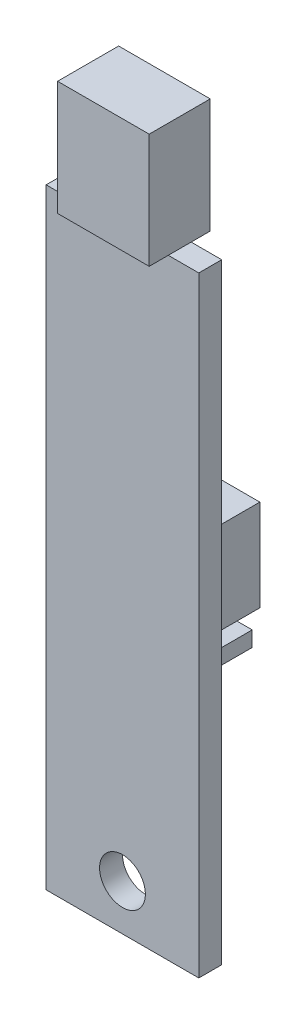
ISO-10303-21;
HEADER;
FILE_DESCRIPTION(('STEP AP214'),'2;1');
FILE_NAME('part.step','',(''),(''),'','','');
FILE_SCHEMA(('AUTOMOTIVE_DESIGN { 1 0 10303 214 1 1 1 1 }'));
ENDSEC;
DATA;
#1=APPLICATION_CONTEXT('core data for automotive mechanical design processes');
#2=APPLICATION_PROTOCOL_DEFINITION('international standard','automotive_design',2000,#1);
#3=PRODUCT_CONTEXT('',#1,'mechanical');
#4=PRODUCT('Part','Part','',(#3));
#5=PRODUCT_RELATED_PRODUCT_CATEGORY('part','',(#4));
#6=PRODUCT_DEFINITION_FORMATION('','',#4);
#7=PRODUCT_DEFINITION_CONTEXT('part definition',#1,'design');
#8=PRODUCT_DEFINITION('design','',#6,#7);
#9=PRODUCT_DEFINITION_SHAPE('','',#8);
#10=(LENGTH_UNIT() NAMED_UNIT(*) SI_UNIT(.MILLI.,.METRE.));
#11=(NAMED_UNIT(*) PLANE_ANGLE_UNIT() SI_UNIT($,.RADIAN.));
#12=(NAMED_UNIT(*) SI_UNIT($,.STERADIAN.) SOLID_ANGLE_UNIT());
#13=UNCERTAINTY_MEASURE_WITH_UNIT(LENGTH_MEASURE(1.E-05),#10,'distance_accuracy_value','');
#14=(GEOMETRIC_REPRESENTATION_CONTEXT(3) GLOBAL_UNCERTAINTY_ASSIGNED_CONTEXT((#13)) GLOBAL_UNIT_ASSIGNED_CONTEXT((#10,
#11,#12)) REPRESENTATION_CONTEXT('',''));
#15=CARTESIAN_POINT('',(0.,0.,0.));
#16=DIRECTION('',(0.,0.,1.));
#17=DIRECTION('',(1.,0.,0.));
#18=AXIS2_PLACEMENT_3D('',#15,#16,#17);
#19=CARTESIAN_POINT('',(0.,40.,1.5));
#20=DIRECTION('',(0.,-1.,0.));
#21=DIRECTION('',(0.,0.,-1.));
#22=AXIS2_PLACEMENT_3D('',#19,#20,#21);
#23=PLANE('',#22);
#24=DIRECTION('',(0.,0.,1.));
#25=VECTOR('',#24,1.);
#26=CARTESIAN_POINT('',(2.,40.,-1.25));
#27=LINE('',#26,#25);
#28=CARTESIAN_POINT('',(2.,40.,0.));
#29=VERTEX_POINT('',#28);
#30=CARTESIAN_POINT('',(2.,40.,1.5));
#31=VERTEX_POINT('',#30);
#32=EDGE_CURVE('E11',#29,#31,#27,.T.);
#33=ORIENTED_EDGE('',*,*,#32,.F.);
#34=DIRECTION('',(-1.,0.,0.));
#35=VECTOR('',#34,1.);
#36=CARTESIAN_POINT('',(0.,40.,0.));
#37=LINE('',#36,#35);
#38=CARTESIAN_POINT('',(0.,40.,0.));
#39=VERTEX_POINT('',#38);
#40=EDGE_CURVE('E438',#29,#39,#37,.T.);
#41=ORIENTED_EDGE('',*,*,#40,.T.);
#42=DIRECTION('',(0.,0.,-1.));
#43=VECTOR('',#42,1.);
#44=CARTESIAN_POINT('',(0.,40.,1.5));
#45=LINE('',#44,#43);
#46=CARTESIAN_POINT('',(0.,40.,1.5));
#47=VERTEX_POINT('',#46);
#48=EDGE_CURVE('E430',#47,#39,#45,.T.);
#49=ORIENTED_EDGE('',*,*,#48,.F.);
#50=DIRECTION('',(-1.,0.,0.));
#51=VECTOR('',#50,1.);
#52=CARTESIAN_POINT('',(0.,40.,1.5));
#53=LINE('',#52,#51);
#54=EDGE_CURVE('E54',#31,#47,#53,.T.);
#55=ORIENTED_EDGE('',*,*,#54,.F.);
#56=EDGE_LOOP('',(#33,#41,#49,#55));
#57=FACE_BOUND('',#56,.T.);
#58=ADVANCED_FACE('F35',(#57),#23,.F.);
#59=DIRECTION('',(0.,0.,-1.));
#60=VECTOR('',#59,1.);
#61=CARTESIAN_POINT('',(8.00000000000001,40.,-1.25));
#62=LINE('',#61,#60);
#63=CARTESIAN_POINT('',(8.00000000000001,40.,1.5));
#64=VERTEX_POINT('',#63);
#65=CARTESIAN_POINT('',(8.00000000000001,40.,0.));
#66=VERTEX_POINT('',#65);
#67=EDGE_CURVE('E44',#64,#66,#62,.T.);
#68=ORIENTED_EDGE('',*,*,#67,.F.);
#69=CARTESIAN_POINT('',(10.,40.,1.5));
#70=VERTEX_POINT('',#69);
#71=EDGE_CURVE('E428',#70,#64,#53,.T.);
#72=ORIENTED_EDGE('',*,*,#71,.F.);
#73=DIRECTION('',(0.,0.,-1.));
#74=VECTOR('',#73,1.);
#75=CARTESIAN_POINT('',(10.,40.,1.5));
#76=LINE('',#75,#74);
#77=CARTESIAN_POINT('',(10.,40.,0.));
#78=VERTEX_POINT('',#77);
#79=EDGE_CURVE('E443',#70,#78,#76,.T.);
#80=ORIENTED_EDGE('',*,*,#79,.T.);
#81=EDGE_CURVE('E424',#78,#66,#37,.T.);
#82=ORIENTED_EDGE('',*,*,#81,.T.);
#83=EDGE_LOOP('',(#68,#72,#80,#82));
#84=FACE_BOUND('',#83,.T.);
#85=ADVANCED_FACE('F514',(#84),#23,.F.);
#86=CARTESIAN_POINT('',(0.,0.,-0.5));
#87=DIRECTION('',(0.,0.,1.));
#88=DIRECTION('',(1.,0.,0.));
#89=AXIS2_PLACEMENT_3D('',#86,#87,#88);
#90=PLANE('',#89);
#91=DIRECTION('',(1.,0.,0.));
#92=VECTOR('',#91,1.);
#93=CARTESIAN_POINT('',(0.,15.5,-0.5));
#94=LINE('',#93,#92);
#95=CARTESIAN_POINT('',(2.5,15.5,-0.5));
#96=VERTEX_POINT('',#95);
#97=CARTESIAN_POINT('',(3.5,15.5,-0.5));
#98=VERTEX_POINT('',#97);
#99=EDGE_CURVE('E264',#96,#98,#94,.T.);
#100=ORIENTED_EDGE('',*,*,#99,.F.);
#101=DIRECTION('',(0.,-1.,0.));
#102=VECTOR('',#101,1.);
#103=CARTESIAN_POINT('',(2.5,0.,-0.5));
#104=LINE('',#103,#102);
#105=CARTESIAN_POINT('',(2.5,14.5,-0.5));
#106=VERTEX_POINT('',#105);
#107=EDGE_CURVE('E261',#96,#106,#104,.T.);
#108=ORIENTED_EDGE('',*,*,#107,.T.);
#109=DIRECTION('',(1.,0.,0.));
#110=VECTOR('',#109,1.);
#111=CARTESIAN_POINT('',(0.,14.5,-0.5));
#112=LINE('',#111,#110);
#113=CARTESIAN_POINT('',(3.5,14.5,-0.5));
#114=VERTEX_POINT('',#113);
#115=EDGE_CURVE('E274',#106,#114,#112,.T.);
#116=ORIENTED_EDGE('',*,*,#115,.T.);
#117=DIRECTION('',(0.,-1.,0.));
#118=VECTOR('',#117,1.);
#119=CARTESIAN_POINT('',(3.5,0.,-0.5));
#120=LINE('',#119,#118);
#121=EDGE_CURVE('E283',#98,#114,#120,.T.);
#122=ORIENTED_EDGE('',*,*,#121,.F.);
#123=EDGE_LOOP('',(#100,#108,#116,#122));
#124=FACE_BOUND('',#123,.T.);
#125=DIRECTION('',(1.,0.,0.));
#126=VECTOR('',#125,1.);
#127=CARTESIAN_POINT('',(0.,15.5,-0.5));
#128=LINE('',#127,#126);
#129=CARTESIAN_POINT('',(4.5,15.5,-0.5));
#130=VERTEX_POINT('',#129);
#131=CARTESIAN_POINT('',(5.5,15.5,-0.5));
#132=VERTEX_POINT('',#131);
#133=EDGE_CURVE('E311',#130,#132,#128,.T.);
#134=ORIENTED_EDGE('',*,*,#133,.F.);
#135=DIRECTION('',(0.,-1.,0.));
#136=VECTOR('',#135,1.);
#137=CARTESIAN_POINT('',(4.5,0.,-0.5));
#138=LINE('',#137,#136);
#139=CARTESIAN_POINT('',(4.5,14.5,-0.5));
#140=VERTEX_POINT('',#139);
#141=EDGE_CURVE('E296',#130,#140,#138,.T.);
#142=ORIENTED_EDGE('',*,*,#141,.T.);
#143=DIRECTION('',(1.,0.,0.));
#144=VECTOR('',#143,1.);
#145=CARTESIAN_POINT('',(0.,14.5,-0.5));
#146=LINE('',#145,#144);
#147=CARTESIAN_POINT('',(5.5,14.5,-0.5));
#148=VERTEX_POINT('',#147);
#149=EDGE_CURVE('E301',#140,#148,#146,.T.);
#150=ORIENTED_EDGE('',*,*,#149,.T.);
#151=DIRECTION('',(0.,-1.,0.));
#152=VECTOR('',#151,1.);
#153=CARTESIAN_POINT('',(5.5,0.,-0.5));
#154=LINE('',#153,#152);
#155=EDGE_CURVE('E313',#132,#148,#154,.T.);
#156=ORIENTED_EDGE('',*,*,#155,.F.);
#157=EDGE_LOOP('',(#134,#142,#150,#156));
#158=FACE_BOUND('',#157,.T.);
#159=DIRECTION('',(1.,0.,0.));
#160=VECTOR('',#159,1.);
#161=CARTESIAN_POINT('',(2.,14.,-0.5));
#162=LINE('',#161,#160);
#163=CARTESIAN_POINT('',(2.,14.,-0.5));
#164=VERTEX_POINT('',#163);
#165=CARTESIAN_POINT('',(8.,14.,-0.5));
#166=VERTEX_POINT('',#165);
#167=EDGE_CURVE('E358',#164,#166,#162,.T.);
#168=ORIENTED_EDGE('',*,*,#167,.F.);
#169=DIRECTION('',(0.,1.,0.));
#170=VECTOR('',#169,1.);
#171=CARTESIAN_POINT('',(2.,14.,-0.5));
#172=LINE('',#171,#170);
#173=CARTESIAN_POINT('',(2.,16.,-0.5));
#174=VERTEX_POINT('',#173);
#175=EDGE_CURVE('E366',#164,#174,#172,.T.);
#176=ORIENTED_EDGE('',*,*,#175,.T.);
#177=DIRECTION('',(1.,0.,0.));
#178=VECTOR('',#177,1.);
#179=CARTESIAN_POINT('',(2.,16.,-0.5));
#180=LINE('',#179,#178);
#181=CARTESIAN_POINT('',(8.,16.,-0.5));
#182=VERTEX_POINT('',#181);
#183=EDGE_CURVE('E364',#174,#182,#180,.T.);
#184=ORIENTED_EDGE('',*,*,#183,.T.);
#185=DIRECTION('',(0.,1.,0.));
#186=VECTOR('',#185,1.);
#187=CARTESIAN_POINT('',(8.,14.,-0.5));
#188=LINE('',#187,#186);
#189=EDGE_CURVE('E361',#166,#182,#188,.T.);
#190=ORIENTED_EDGE('',*,*,#189,.F.);
#191=EDGE_LOOP('',(#168,#176,#184,#190));
#192=FACE_BOUND('',#191,.T.);
#193=DIRECTION('',(1.,0.,0.));
#194=VECTOR('',#193,1.);
#195=CARTESIAN_POINT('',(0.,15.5,-0.5));
#196=LINE('',#195,#194);
#197=CARTESIAN_POINT('',(6.5,15.5,-0.5));
#198=VERTEX_POINT('',#197);
#199=CARTESIAN_POINT('',(7.5,15.5,-0.5));
#200=VERTEX_POINT('',#199);
#201=EDGE_CURVE('E326',#198,#200,#196,.T.);
#202=ORIENTED_EDGE('',*,*,#201,.F.);
#203=DIRECTION('',(0.,-1.,0.));
#204=VECTOR('',#203,1.);
#205=CARTESIAN_POINT('',(6.5,0.,-0.5));
#206=LINE('',#205,#204);
#207=CARTESIAN_POINT('',(6.5,14.5,-0.5));
#208=VERTEX_POINT('',#207);
#209=EDGE_CURVE('E331',#198,#208,#206,.T.);
#210=ORIENTED_EDGE('',*,*,#209,.T.);
#211=DIRECTION('',(1.,0.,0.));
#212=VECTOR('',#211,1.);
#213=CARTESIAN_POINT('',(0.,14.5,-0.5));
#214=LINE('',#213,#212);
#215=CARTESIAN_POINT('',(7.5,14.5,-0.5));
#216=VERTEX_POINT('',#215);
#217=EDGE_CURVE('E345',#208,#216,#214,.T.);
#218=ORIENTED_EDGE('',*,*,#217,.T.);
#219=DIRECTION('',(0.,-1.,0.));
#220=VECTOR('',#219,1.);
#221=CARTESIAN_POINT('',(7.5,0.,-0.5));
#222=LINE('',#221,#220);
#223=EDGE_CURVE('E342',#200,#216,#222,.T.);
#224=ORIENTED_EDGE('',*,*,#223,.F.);
#225=EDGE_LOOP('',(#202,#210,#218,#224));
#226=FACE_BOUND('',#225,.T.);
#227=ADVANCED_FACE('F519',(#124,#158,#192,#226),#90,.F.);
#228=CARTESIAN_POINT('',(0.,0.,0.));
#229=DIRECTION('',(0.,0.,-1.));
#230=DIRECTION('',(-1.,0.,0.));
#231=AXIS2_PLACEMENT_3D('',#228,#229,#230);
#232=PLANE('',#231);
#233=DIRECTION('',(-1.,0.,0.));
#234=VECTOR('',#233,1.);
#235=CARTESIAN_POINT('',(0.,14.,0.));
#236=LINE('',#235,#234);
#237=CARTESIAN_POINT('',(8.,14.,0.));
#238=VERTEX_POINT('',#237);
#239=CARTESIAN_POINT('',(2.,14.,0.));
#240=VERTEX_POINT('',#239);
#241=EDGE_CURVE('E387',#238,#240,#236,.T.);
#242=ORIENTED_EDGE('',*,*,#241,.F.);
#243=DIRECTION('',(0.,-1.,0.));
#244=VECTOR('',#243,1.);
#245=CARTESIAN_POINT('',(8.,0.,0.));
#246=LINE('',#245,#244);
#247=CARTESIAN_POINT('',(8.,16.,0.));
#248=VERTEX_POINT('',#247);
#249=EDGE_CURVE('E372',#248,#238,#246,.T.);
#250=ORIENTED_EDGE('',*,*,#249,.F.);
#251=DIRECTION('',(-1.,0.,0.));
#252=VECTOR('',#251,1.);
#253=CARTESIAN_POINT('',(0.,16.,0.));
#254=LINE('',#253,#252);
#255=CARTESIAN_POINT('',(2.,16.,0.));
#256=VERTEX_POINT('',#255);
#257=EDGE_CURVE('E383',#248,#256,#254,.T.);
#258=ORIENTED_EDGE('',*,*,#257,.T.);
#259=DIRECTION('',(0.,-1.,0.));
#260=VECTOR('',#259,1.);
#261=CARTESIAN_POINT('',(2.,0.,0.));
#262=LINE('',#261,#260);
#263=EDGE_CURVE('E385',#256,#240,#262,.T.);
#264=ORIENTED_EDGE('',*,*,#263,.T.);
#265=EDGE_LOOP('',(#242,#250,#258,#264));
#266=FACE_BOUND('',#265,.T.);
#267=CARTESIAN_POINT('',(5.,3.,0.));
#268=DIRECTION('',(0.,0.,1.));
#269=DIRECTION('',(1.,0.,0.));
#270=AXIS2_PLACEMENT_3D('',#267,#268,#269);
#271=CIRCLE('',#270,1.5);
#272=CARTESIAN_POINT('',(6.5,3.,0.));
#273=VERTEX_POINT('',#272);
#274=EDGE_CURVE('E413',#273,#273,#271,.T.);
#275=ORIENTED_EDGE('',*,*,#274,.T.);
#276=EDGE_LOOP('',(#275));
#277=FACE_BOUND('',#276,.T.);
#278=DIRECTION('',(0.,-1.,0.));
#279=VECTOR('',#278,1.);
#280=CARTESIAN_POINT('',(0.,0.,0.));
#281=LINE('',#280,#279);
#282=CARTESIAN_POINT('',(0.,0.,0.));
#283=VERTEX_POINT('',#282);
#284=EDGE_CURVE('E417',#39,#283,#281,.T.);
#285=ORIENTED_EDGE('',*,*,#284,.F.);
#286=ORIENTED_EDGE('',*,*,#40,.F.);
#287=EDGE_CURVE('E440',#66,#29,#37,.T.);
#288=ORIENTED_EDGE('',*,*,#287,.F.);
#289=ORIENTED_EDGE('',*,*,#81,.F.);
#290=DIRECTION('',(0.,1.,0.));
#291=VECTOR('',#290,1.);
#292=CARTESIAN_POINT('',(10.,0.,0.));
#293=LINE('',#292,#291);
#294=CARTESIAN_POINT('',(10.,0.,0.));
#295=VERTEX_POINT('',#294);
#296=EDGE_CURVE('E436',#295,#78,#293,.T.);
#297=ORIENTED_EDGE('',*,*,#296,.F.);
#298=DIRECTION('',(1.,0.,0.));
#299=VECTOR('',#298,1.);
#300=CARTESIAN_POINT('',(0.,0.,0.));
#301=LINE('',#300,#299);
#302=EDGE_CURVE('E434',#283,#295,#301,.T.);
#303=ORIENTED_EDGE('',*,*,#302,.F.);
#304=EDGE_LOOP('',(#285,#286,#288,#289,#297,#303));
#305=FACE_BOUND('',#304,.T.);
#306=DIRECTION('',(1.,0.,0.));
#307=VECTOR('',#306,1.);
#308=CARTESIAN_POINT('',(0.,17.,0.));
#309=LINE('',#308,#307);
#310=CARTESIAN_POINT('',(2.,17.,0.));
#311=VERTEX_POINT('',#310);
#312=CARTESIAN_POINT('',(8.,17.,0.));
#313=VERTEX_POINT('',#312);
#314=EDGE_CURVE('E457',#311,#313,#309,.T.);
#315=ORIENTED_EDGE('',*,*,#314,.T.);
#316=DIRECTION('',(0.,1.,0.));
#317=VECTOR('',#316,1.);
#318=CARTESIAN_POINT('',(8.,0.,0.));
#319=LINE('',#318,#317);
#320=CARTESIAN_POINT('',(8.,23.,0.));
#321=VERTEX_POINT('',#320);
#322=EDGE_CURVE('E39',#313,#321,#319,.T.);
#323=ORIENTED_EDGE('',*,*,#322,.T.);
#324=DIRECTION('',(1.,0.,0.));
#325=VECTOR('',#324,1.);
#326=CARTESIAN_POINT('',(0.,23.,0.));
#327=LINE('',#326,#325);
#328=CARTESIAN_POINT('',(2.,23.,0.));
#329=VERTEX_POINT('',#328);
#330=EDGE_CURVE('E452',#329,#321,#327,.T.);
#331=ORIENTED_EDGE('',*,*,#330,.F.);
#332=DIRECTION('',(0.,1.,0.));
#333=VECTOR('',#332,1.);
#334=CARTESIAN_POINT('',(2.,0.,0.));
#335=LINE('',#334,#333);
#336=EDGE_CURVE('E455',#311,#329,#335,.T.);
#337=ORIENTED_EDGE('',*,*,#336,.F.);
#338=EDGE_LOOP('',(#315,#323,#331,#337));
#339=FACE_BOUND('',#338,.T.);
#340=ADVANCED_FACE('F492',(#266,#277,#305,#339),#232,.T.);
#341=CARTESIAN_POINT('',(0.,0.,1.5));
#342=DIRECTION('',(0.,0.,-1.));
#343=DIRECTION('',(-1.,0.,0.));
#344=AXIS2_PLACEMENT_3D('',#341,#342,#343);
#345=PLANE('',#344);
#346=CARTESIAN_POINT('',(5.,3.,1.5));
#347=DIRECTION('',(0.,0.,1.));
#348=DIRECTION('',(1.,0.,0.));
#349=AXIS2_PLACEMENT_3D('',#346,#347,#348);
#350=CIRCLE('',#349,1.5);
#351=CARTESIAN_POINT('',(6.5,3.,1.5));
#352=VERTEX_POINT('',#351);
#353=EDGE_CURVE('E414',#352,#352,#350,.T.);
#354=ORIENTED_EDGE('',*,*,#353,.F.);
#355=EDGE_LOOP('',(#354));
#356=FACE_BOUND('',#355,.T.);
#357=DIRECTION('',(0.,-1.,0.));
#358=VECTOR('',#357,1.);
#359=CARTESIAN_POINT('',(0.,0.,1.5));
#360=LINE('',#359,#358);
#361=CARTESIAN_POINT('',(0.,0.,1.5));
#362=VERTEX_POINT('',#361);
#363=EDGE_CURVE('E420',#47,#362,#360,.T.);
#364=ORIENTED_EDGE('',*,*,#363,.T.);
#365=DIRECTION('',(1.,0.,0.));
#366=VECTOR('',#365,1.);
#367=CARTESIAN_POINT('',(0.,0.,1.5));
#368=LINE('',#367,#366);
#369=CARTESIAN_POINT('',(10.,0.,1.5));
#370=VERTEX_POINT('',#369);
#371=EDGE_CURVE('E423',#362,#370,#368,.T.);
#372=ORIENTED_EDGE('',*,*,#371,.T.);
#373=DIRECTION('',(0.,1.,0.));
#374=VECTOR('',#373,1.);
#375=CARTESIAN_POINT('',(10.,0.,1.5));
#376=LINE('',#375,#374);
#377=EDGE_CURVE('E426',#370,#70,#376,.T.);
#378=ORIENTED_EDGE('',*,*,#377,.T.);
#379=ORIENTED_EDGE('',*,*,#71,.T.);
#380=EDGE_CURVE('E431',#64,#31,#53,.T.);
#381=ORIENTED_EDGE('',*,*,#380,.T.);
#382=ORIENTED_EDGE('',*,*,#54,.T.);
#383=EDGE_LOOP('',(#364,#372,#378,#379,#381,#382));
#384=FACE_BOUND('',#383,.T.);
#385=ADVANCED_FACE('F499',(#356,#384),#345,.F.);
#386=CARTESIAN_POINT('',(0.,0.,1.5));
#387=DIRECTION('',(1.,0.,0.));
#388=DIRECTION('',(0.,0.,-1.));
#389=AXIS2_PLACEMENT_3D('',#386,#387,#388);
#390=PLANE('',#389);
#391=ORIENTED_EDGE('',*,*,#284,.T.);
#392=DIRECTION('',(0.,0.,-1.));
#393=VECTOR('',#392,1.);
#394=CARTESIAN_POINT('',(0.,0.,1.5));
#395=LINE('',#394,#393);
#396=EDGE_CURVE('E449',#362,#283,#395,.T.);
#397=ORIENTED_EDGE('',*,*,#396,.F.);
#398=ORIENTED_EDGE('',*,*,#363,.F.);
#399=ORIENTED_EDGE('',*,*,#48,.T.);
#400=EDGE_LOOP('',(#391,#397,#398,#399));
#401=FACE_BOUND('',#400,.T.);
#402=ADVANCED_FACE('F37',(#401),#390,.F.);
#403=CARTESIAN_POINT('',(0.,0.,1.5));
#404=DIRECTION('',(0.,1.,0.));
#405=DIRECTION('',(0.,0.,1.));
#406=AXIS2_PLACEMENT_3D('',#403,#404,#405);
#407=PLANE('',#406);
#408=ORIENTED_EDGE('',*,*,#302,.T.);
#409=DIRECTION('',(0.,0.,-1.));
#410=VECTOR('',#409,1.);
#411=CARTESIAN_POINT('',(10.,0.,1.5));
#412=LINE('',#411,#410);
#413=EDGE_CURVE('E446',#370,#295,#412,.T.);
#414=ORIENTED_EDGE('',*,*,#413,.F.);
#415=ORIENTED_EDGE('',*,*,#371,.F.);
#416=ORIENTED_EDGE('',*,*,#396,.T.);
#417=EDGE_LOOP('',(#408,#414,#415,#416));
#418=FACE_BOUND('',#417,.T.);
#419=ADVANCED_FACE('F496',(#418),#407,.F.);
#420=CARTESIAN_POINT('',(10.,0.,1.5));
#421=DIRECTION('',(-1.,0.,0.));
#422=DIRECTION('',(0.,0.,1.));
#423=AXIS2_PLACEMENT_3D('',#420,#421,#422);
#424=PLANE('',#423);
#425=ORIENTED_EDGE('',*,*,#296,.T.);
#426=ORIENTED_EDGE('',*,*,#79,.F.);
#427=ORIENTED_EDGE('',*,*,#377,.F.);
#428=ORIENTED_EDGE('',*,*,#413,.T.);
#429=EDGE_LOOP('',(#425,#426,#427,#428));
#430=FACE_BOUND('',#429,.T.);
#431=ADVANCED_FACE('F523',(#430),#424,.F.);
#432=CARTESIAN_POINT('',(5.,3.,1.5));
#433=DIRECTION('',(0.,0.,-1.));
#434=DIRECTION('',(-1.,0.,0.));
#435=AXIS2_PLACEMENT_3D('',#432,#433,#434);
#436=CYLINDRICAL_SURFACE('',#435,1.5);
#437=ORIENTED_EDGE('',*,*,#353,.T.);
#438=EDGE_LOOP('',(#437));
#439=FACE_BOUND('',#438,.T.);
#440=ORIENTED_EDGE('',*,*,#274,.F.);
#441=EDGE_LOOP('',(#440));
#442=FACE_BOUND('',#441,.T.);
#443=ADVANCED_FACE('F525',(#439,#442),#436,.F.);
#444=CARTESIAN_POINT('',(8.,23.,-4.5));
#445=DIRECTION('',(-1.,0.,0.));
#446=DIRECTION('',(0.,0.,1.));
#447=AXIS2_PLACEMENT_3D('',#444,#445,#446);
#448=PLANE('',#447);
#449=ORIENTED_EDGE('',*,*,#322,.F.);
#450=DIRECTION('',(0.,0.,1.));
#451=VECTOR('',#450,1.);
#452=CARTESIAN_POINT('',(8.,17.,-4.5));
#453=LINE('',#452,#451);
#454=CARTESIAN_POINT('',(8.,17.,-4.5));
#455=VERTEX_POINT('',#454);
#456=EDGE_CURVE('E410',#455,#313,#453,.T.);
#457=ORIENTED_EDGE('',*,*,#456,.F.);
#458=DIRECTION('',(0.,-1.,0.));
#459=VECTOR('',#458,1.);
#460=CARTESIAN_POINT('',(8.,23.,-4.5));
#461=LINE('',#460,#459);
#462=CARTESIAN_POINT('',(8.,23.,-4.5));
#463=VERTEX_POINT('',#462);
#464=EDGE_CURVE('E390',#463,#455,#461,.T.);
#465=ORIENTED_EDGE('',*,*,#464,.F.);
#466=DIRECTION('',(0.,0.,1.));
#467=VECTOR('',#466,1.);
#468=CARTESIAN_POINT('',(8.,23.,-4.5));
#469=LINE('',#468,#467);
#470=EDGE_CURVE('E401',#463,#321,#469,.T.);
#471=ORIENTED_EDGE('',*,*,#470,.T.);
#472=EDGE_LOOP('',(#449,#457,#465,#471));
#473=FACE_BOUND('',#472,.T.);
#474=ADVANCED_FACE('F543',(#473),#448,.F.);
#475=CARTESIAN_POINT('',(8.,17.,-4.5));
#476=DIRECTION('',(0.,1.,0.));
#477=DIRECTION('',(0.,0.,1.));
#478=AXIS2_PLACEMENT_3D('',#475,#476,#477);
#479=PLANE('',#478);
#480=ORIENTED_EDGE('',*,*,#314,.F.);
#481=DIRECTION('',(0.,0.,1.));
#482=VECTOR('',#481,1.);
#483=CARTESIAN_POINT('',(2.,17.,-4.5));
#484=LINE('',#483,#482);
#485=CARTESIAN_POINT('',(2.,17.,-4.5));
#486=VERTEX_POINT('',#485);
#487=EDGE_CURVE('E407',#486,#311,#484,.T.);
#488=ORIENTED_EDGE('',*,*,#487,.F.);
#489=DIRECTION('',(-1.,0.,0.));
#490=VECTOR('',#489,1.);
#491=CARTESIAN_POINT('',(8.,17.,-4.5));
#492=LINE('',#491,#490);
#493=EDGE_CURVE('E393',#455,#486,#492,.T.);
#494=ORIENTED_EDGE('',*,*,#493,.F.);
#495=ORIENTED_EDGE('',*,*,#456,.T.);
#496=EDGE_LOOP('',(#480,#488,#494,#495));
#497=FACE_BOUND('',#496,.T.);
#498=ADVANCED_FACE('F547',(#497),#479,.F.);
#499=CARTESIAN_POINT('',(2.,23.,-4.5));
#500=DIRECTION('',(-1.,0.,0.));
#501=DIRECTION('',(0.,0.,1.));
#502=AXIS2_PLACEMENT_3D('',#499,#500,#501);
#503=PLANE('',#502);
#504=ORIENTED_EDGE('',*,*,#487,.T.);
#505=ORIENTED_EDGE('',*,*,#336,.T.);
#506=DIRECTION('',(0.,0.,1.));
#507=VECTOR('',#506,1.);
#508=CARTESIAN_POINT('',(2.,23.,-4.5));
#509=LINE('',#508,#507);
#510=CARTESIAN_POINT('',(2.,23.,-4.5));
#511=VERTEX_POINT('',#510);
#512=EDGE_CURVE('E404',#511,#329,#509,.T.);
#513=ORIENTED_EDGE('',*,*,#512,.F.);
#514=DIRECTION('',(0.,-1.,0.));
#515=VECTOR('',#514,1.);
#516=CARTESIAN_POINT('',(2.,23.,-4.5));
#517=LINE('',#516,#515);
#518=EDGE_CURVE('E395',#511,#486,#517,.T.);
#519=ORIENTED_EDGE('',*,*,#518,.T.);
#520=EDGE_LOOP('',(#504,#505,#513,#519));
#521=FACE_BOUND('',#520,.T.);
#522=ADVANCED_FACE('F551',(#521),#503,.T.);
#523=CARTESIAN_POINT('',(8.,23.,-4.5));
#524=DIRECTION('',(0.,1.,0.));
#525=DIRECTION('',(0.,0.,1.));
#526=AXIS2_PLACEMENT_3D('',#523,#524,#525);
#527=PLANE('',#526);
#528=ORIENTED_EDGE('',*,*,#512,.T.);
#529=ORIENTED_EDGE('',*,*,#330,.T.);
#530=ORIENTED_EDGE('',*,*,#470,.F.);
#531=DIRECTION('',(-1.,0.,0.));
#532=VECTOR('',#531,1.);
#533=CARTESIAN_POINT('',(8.,23.,-4.5));
#534=LINE('',#533,#532);
#535=EDGE_CURVE('E398',#463,#511,#534,.T.);
#536=ORIENTED_EDGE('',*,*,#535,.T.);
#537=EDGE_LOOP('',(#528,#529,#530,#536));
#538=FACE_BOUND('',#537,.T.);
#539=ADVANCED_FACE('F555',(#538),#527,.T.);
#540=CARTESIAN_POINT('',(0.,0.,-4.5));
#541=DIRECTION('',(0.,0.,-1.));
#542=DIRECTION('',(-1.,0.,0.));
#543=AXIS2_PLACEMENT_3D('',#540,#541,#542);
#544=PLANE('',#543);
#545=ORIENTED_EDGE('',*,*,#464,.T.);
#546=ORIENTED_EDGE('',*,*,#493,.T.);
#547=ORIENTED_EDGE('',*,*,#518,.F.);
#548=ORIENTED_EDGE('',*,*,#535,.F.);
#549=EDGE_LOOP('',(#545,#546,#547,#548));
#550=FACE_BOUND('',#549,.T.);
#551=ADVANCED_FACE('F559',(#550),#544,.T.);
#552=CARTESIAN_POINT('',(2.,14.,-0.5));
#553=DIRECTION('',(0.,-1.,0.));
#554=DIRECTION('',(0.,0.,-1.));
#555=AXIS2_PLACEMENT_3D('',#552,#553,#554);
#556=PLANE('',#555);
#557=DIRECTION('',(0.,0.,1.));
#558=VECTOR('',#557,1.);
#559=CARTESIAN_POINT('',(8.,14.,-0.5));
#560=LINE('',#559,#558);
#561=EDGE_CURVE('E368',#166,#238,#560,.T.);
#562=ORIENTED_EDGE('',*,*,#561,.T.);
#563=ORIENTED_EDGE('',*,*,#241,.T.);
#564=DIRECTION('',(0.,0.,1.));
#565=VECTOR('',#564,1.);
#566=CARTESIAN_POINT('',(2.,14.,-0.5));
#567=LINE('',#566,#565);
#568=EDGE_CURVE('E369',#164,#240,#567,.T.);
#569=ORIENTED_EDGE('',*,*,#568,.F.);
#570=ORIENTED_EDGE('',*,*,#167,.T.);
#571=EDGE_LOOP('',(#562,#563,#569,#570));
#572=FACE_BOUND('',#571,.T.);
#573=ADVANCED_FACE('F563',(#572),#556,.T.);
#574=CARTESIAN_POINT('',(2.,14.,-0.5));
#575=DIRECTION('',(1.,0.,0.));
#576=DIRECTION('',(0.,0.,-1.));
#577=AXIS2_PLACEMENT_3D('',#574,#575,#576);
#578=PLANE('',#577);
#579=ORIENTED_EDGE('',*,*,#263,.F.);
#580=DIRECTION('',(0.,0.,1.));
#581=VECTOR('',#580,1.);
#582=CARTESIAN_POINT('',(2.,16.,-0.5));
#583=LINE('',#582,#581);
#584=EDGE_CURVE('E373',#174,#256,#583,.T.);
#585=ORIENTED_EDGE('',*,*,#584,.F.);
#586=ORIENTED_EDGE('',*,*,#175,.F.);
#587=ORIENTED_EDGE('',*,*,#568,.T.);
#588=EDGE_LOOP('',(#579,#585,#586,#587));
#589=FACE_BOUND('',#588,.T.);
#590=ADVANCED_FACE('F567',(#589),#578,.F.);
#591=CARTESIAN_POINT('',(2.,16.,-0.5));
#592=DIRECTION('',(0.,-1.,0.));
#593=DIRECTION('',(0.,0.,-1.));
#594=AXIS2_PLACEMENT_3D('',#591,#592,#593);
#595=PLANE('',#594);
#596=ORIENTED_EDGE('',*,*,#257,.F.);
#597=DIRECTION('',(0.,0.,1.));
#598=VECTOR('',#597,1.);
#599=CARTESIAN_POINT('',(8.,16.,-0.5));
#600=LINE('',#599,#598);
#601=EDGE_CURVE('E376',#182,#248,#600,.T.);
#602=ORIENTED_EDGE('',*,*,#601,.F.);
#603=ORIENTED_EDGE('',*,*,#183,.F.);
#604=ORIENTED_EDGE('',*,*,#584,.T.);
#605=EDGE_LOOP('',(#596,#602,#603,#604));
#606=FACE_BOUND('',#605,.T.);
#607=ADVANCED_FACE('F573',(#606),#595,.F.);
#608=CARTESIAN_POINT('',(8.,14.,-0.5));
#609=DIRECTION('',(1.,0.,0.));
#610=DIRECTION('',(0.,0.,-1.));
#611=AXIS2_PLACEMENT_3D('',#608,#609,#610);
#612=PLANE('',#611);
#613=ORIENTED_EDGE('',*,*,#601,.T.);
#614=ORIENTED_EDGE('',*,*,#249,.T.);
#615=ORIENTED_EDGE('',*,*,#561,.F.);
#616=ORIENTED_EDGE('',*,*,#189,.T.);
#617=EDGE_LOOP('',(#613,#614,#615,#616));
#618=FACE_BOUND('',#617,.T.);
#619=ADVANCED_FACE('F569',(#618),#612,.T.);
#620=CARTESIAN_POINT('',(0.,15.5,-4.5));
#621=DIRECTION('',(0.,-1.,0.));
#622=DIRECTION('',(0.,0.,-1.));
#623=AXIS2_PLACEMENT_3D('',#620,#621,#622);
#624=PLANE('',#623);
#625=ORIENTED_EDGE('',*,*,#201,.T.);
#626=DIRECTION('',(0.,0.,1.));
#627=VECTOR('',#626,1.);
#628=CARTESIAN_POINT('',(7.5,15.5,-4.5));
#629=LINE('',#628,#627);
#630=CARTESIAN_POINT('',(7.5,15.5,-4.5));
#631=VERTEX_POINT('',#630);
#632=EDGE_CURVE('E356',#631,#200,#629,.T.);
#633=ORIENTED_EDGE('',*,*,#632,.F.);
#634=DIRECTION('',(1.,0.,0.));
#635=VECTOR('',#634,1.);
#636=CARTESIAN_POINT('',(0.,15.5,-4.5));
#637=LINE('',#636,#635);
#638=CARTESIAN_POINT('',(6.5,15.5,-4.5));
#639=VERTEX_POINT('',#638);
#640=EDGE_CURVE('E327',#639,#631,#637,.T.);
#641=ORIENTED_EDGE('',*,*,#640,.F.);
#642=DIRECTION('',(0.,0.,1.));
#643=VECTOR('',#642,1.);
#644=CARTESIAN_POINT('',(6.5,15.5,-4.5));
#645=LINE('',#644,#643);
#646=EDGE_CURVE('E339',#639,#198,#645,.T.);
#647=ORIENTED_EDGE('',*,*,#646,.T.);
#648=EDGE_LOOP('',(#625,#633,#641,#647));
#649=FACE_BOUND('',#648,.T.);
#650=ADVANCED_FACE('F572',(#649),#624,.F.);
#651=CARTESIAN_POINT('',(7.5,0.,-4.5));
#652=DIRECTION('',(-1.,0.,0.));
#653=DIRECTION('',(0.,0.,1.));
#654=AXIS2_PLACEMENT_3D('',#651,#652,#653);
#655=PLANE('',#654);
#656=ORIENTED_EDGE('',*,*,#223,.T.);
#657=DIRECTION('',(0.,0.,1.));
#658=VECTOR('',#657,1.);
#659=CARTESIAN_POINT('',(7.5,14.5,-4.5));
#660=LINE('',#659,#658);
#661=CARTESIAN_POINT('',(7.5,14.5,-4.5));
#662=VERTEX_POINT('',#661);
#663=EDGE_CURVE('E354',#662,#216,#660,.T.);
#664=ORIENTED_EDGE('',*,*,#663,.F.);
#665=DIRECTION('',(0.,-1.,0.));
#666=VECTOR('',#665,1.);
#667=CARTESIAN_POINT('',(7.5,0.,-4.5));
#668=LINE('',#667,#666);
#669=EDGE_CURVE('E330',#631,#662,#668,.T.);
#670=ORIENTED_EDGE('',*,*,#669,.F.);
#671=ORIENTED_EDGE('',*,*,#632,.T.);
#672=EDGE_LOOP('',(#656,#664,#670,#671));
#673=FACE_BOUND('',#672,.T.);
#674=ADVANCED_FACE('F586',(#673),#655,.F.);
#675=CARTESIAN_POINT('',(0.,14.5,-4.5));
#676=DIRECTION('',(0.,-1.,0.));
#677=DIRECTION('',(0.,0.,-1.));
#678=AXIS2_PLACEMENT_3D('',#675,#676,#677);
#679=PLANE('',#678);
#680=ORIENTED_EDGE('',*,*,#217,.F.);
#681=DIRECTION('',(0.,0.,1.));
#682=VECTOR('',#681,1.);
#683=CARTESIAN_POINT('',(6.5,14.5,-4.5));
#684=LINE('',#683,#682);
#685=CARTESIAN_POINT('',(6.5,14.5,-4.5));
#686=VERTEX_POINT('',#685);
#687=EDGE_CURVE('E351',#686,#208,#684,.T.);
#688=ORIENTED_EDGE('',*,*,#687,.F.);
#689=DIRECTION('',(1.,0.,0.));
#690=VECTOR('',#689,1.);
#691=CARTESIAN_POINT('',(0.,14.5,-4.5));
#692=LINE('',#691,#690);
#693=EDGE_CURVE('E333',#686,#662,#692,.T.);
#694=ORIENTED_EDGE('',*,*,#693,.T.);
#695=ORIENTED_EDGE('',*,*,#663,.T.);
#696=EDGE_LOOP('',(#680,#688,#694,#695));
#697=FACE_BOUND('',#696,.T.);
#698=ADVANCED_FACE('F590',(#697),#679,.T.);
#699=CARTESIAN_POINT('',(6.5,0.,-4.5));
#700=DIRECTION('',(-1.,0.,0.));
#701=DIRECTION('',(0.,0.,1.));
#702=AXIS2_PLACEMENT_3D('',#699,#700,#701);
#703=PLANE('',#702);
#704=ORIENTED_EDGE('',*,*,#209,.F.);
#705=ORIENTED_EDGE('',*,*,#646,.F.);
#706=DIRECTION('',(0.,-1.,0.));
#707=VECTOR('',#706,1.);
#708=CARTESIAN_POINT('',(6.5,0.,-4.5));
#709=LINE('',#708,#707);
#710=EDGE_CURVE('E336',#639,#686,#709,.T.);
#711=ORIENTED_EDGE('',*,*,#710,.T.);
#712=ORIENTED_EDGE('',*,*,#687,.T.);
#713=EDGE_LOOP('',(#704,#705,#711,#712));
#714=FACE_BOUND('',#713,.T.);
#715=ADVANCED_FACE('F594',(#714),#703,.T.);
#716=CARTESIAN_POINT('',(0.,0.,-4.5));
#717=DIRECTION('',(0.,0.,-1.));
#718=DIRECTION('',(-1.,0.,0.));
#719=AXIS2_PLACEMENT_3D('',#716,#717,#718);
#720=PLANE('',#719);
#721=ORIENTED_EDGE('',*,*,#640,.T.);
#722=ORIENTED_EDGE('',*,*,#669,.T.);
#723=ORIENTED_EDGE('',*,*,#693,.F.);
#724=ORIENTED_EDGE('',*,*,#710,.F.);
#725=EDGE_LOOP('',(#721,#722,#723,#724));
#726=FACE_BOUND('',#725,.T.);
#727=ADVANCED_FACE('F598',(#726),#720,.T.);
#728=CARTESIAN_POINT('',(4.5,0.,-4.5));
#729=DIRECTION('',(-1.,0.,0.));
#730=DIRECTION('',(0.,0.,1.));
#731=AXIS2_PLACEMENT_3D('',#728,#729,#730);
#732=PLANE('',#731);
#733=ORIENTED_EDGE('',*,*,#141,.F.);
#734=DIRECTION('',(0.,0.,1.));
#735=VECTOR('',#734,1.);
#736=CARTESIAN_POINT('',(4.5,15.5,-4.5));
#737=LINE('',#736,#735);
#738=CARTESIAN_POINT('',(4.5,15.5,-4.5));
#739=VERTEX_POINT('',#738);
#740=EDGE_CURVE('E324',#739,#130,#737,.T.);
#741=ORIENTED_EDGE('',*,*,#740,.F.);
#742=DIRECTION('',(0.,-1.,0.));
#743=VECTOR('',#742,1.);
#744=CARTESIAN_POINT('',(4.5,0.,-4.5));
#745=LINE('',#744,#743);
#746=CARTESIAN_POINT('',(4.5,14.5,-4.5));
#747=VERTEX_POINT('',#746);
#748=EDGE_CURVE('E297',#739,#747,#745,.T.);
#749=ORIENTED_EDGE('',*,*,#748,.T.);
#750=DIRECTION('',(0.,0.,1.));
#751=VECTOR('',#750,1.);
#752=CARTESIAN_POINT('',(4.5,14.5,-4.5));
#753=LINE('',#752,#751);
#754=EDGE_CURVE('E308',#747,#140,#753,.T.);
#755=ORIENTED_EDGE('',*,*,#754,.T.);
#756=EDGE_LOOP('',(#733,#741,#749,#755));
#757=FACE_BOUND('',#756,.T.);
#758=ADVANCED_FACE('F602',(#757),#732,.T.);
#759=CARTESIAN_POINT('',(0.,15.5,-4.5));
#760=DIRECTION('',(0.,-1.,0.));
#761=DIRECTION('',(0.,0.,-1.));
#762=AXIS2_PLACEMENT_3D('',#759,#760,#761);
#763=PLANE('',#762);
#764=ORIENTED_EDGE('',*,*,#133,.T.);
#765=DIRECTION('',(0.,0.,1.));
#766=VECTOR('',#765,1.);
#767=CARTESIAN_POINT('',(5.5,15.5,-4.5));
#768=LINE('',#767,#766);
#769=CARTESIAN_POINT('',(5.5,15.5,-4.5));
#770=VERTEX_POINT('',#769);
#771=EDGE_CURVE('E321',#770,#132,#768,.T.);
#772=ORIENTED_EDGE('',*,*,#771,.F.);
#773=DIRECTION('',(1.,0.,0.));
#774=VECTOR('',#773,1.);
#775=CARTESIAN_POINT('',(0.,15.5,-4.5));
#776=LINE('',#775,#774);
#777=EDGE_CURVE('E300',#739,#770,#776,.T.);
#778=ORIENTED_EDGE('',*,*,#777,.F.);
#779=ORIENTED_EDGE('',*,*,#740,.T.);
#780=EDGE_LOOP('',(#764,#772,#778,#779));
#781=FACE_BOUND('',#780,.T.);
#782=ADVANCED_FACE('F606',(#781),#763,.F.);
#783=CARTESIAN_POINT('',(5.5,0.,-4.5));
#784=DIRECTION('',(-1.,0.,0.));
#785=DIRECTION('',(0.,0.,1.));
#786=AXIS2_PLACEMENT_3D('',#783,#784,#785);
#787=PLANE('',#786);
#788=ORIENTED_EDGE('',*,*,#155,.T.);
#789=DIRECTION('',(0.,0.,1.));
#790=VECTOR('',#789,1.);
#791=CARTESIAN_POINT('',(5.5,14.5,-4.5));
#792=LINE('',#791,#790);
#793=CARTESIAN_POINT('',(5.5,14.5,-4.5));
#794=VERTEX_POINT('',#793);
#795=EDGE_CURVE('E318',#794,#148,#792,.T.);
#796=ORIENTED_EDGE('',*,*,#795,.F.);
#797=DIRECTION('',(0.,-1.,0.));
#798=VECTOR('',#797,1.);
#799=CARTESIAN_POINT('',(5.5,0.,-4.5));
#800=LINE('',#799,#798);
#801=EDGE_CURVE('E303',#770,#794,#800,.T.);
#802=ORIENTED_EDGE('',*,*,#801,.F.);
#803=ORIENTED_EDGE('',*,*,#771,.T.);
#804=EDGE_LOOP('',(#788,#796,#802,#803));
#805=FACE_BOUND('',#804,.T.);
#806=ADVANCED_FACE('F610',(#805),#787,.F.);
#807=CARTESIAN_POINT('',(0.,14.5,-4.5));
#808=DIRECTION('',(0.,-1.,0.));
#809=DIRECTION('',(0.,0.,-1.));
#810=AXIS2_PLACEMENT_3D('',#807,#808,#809);
#811=PLANE('',#810);
#812=ORIENTED_EDGE('',*,*,#149,.F.);
#813=ORIENTED_EDGE('',*,*,#754,.F.);
#814=DIRECTION('',(1.,0.,0.));
#815=VECTOR('',#814,1.);
#816=CARTESIAN_POINT('',(0.,14.5,-4.5));
#817=LINE('',#816,#815);
#818=EDGE_CURVE('E305',#747,#794,#817,.T.);
#819=ORIENTED_EDGE('',*,*,#818,.T.);
#820=ORIENTED_EDGE('',*,*,#795,.T.);
#821=EDGE_LOOP('',(#812,#813,#819,#820));
#822=FACE_BOUND('',#821,.T.);
#823=ADVANCED_FACE('F614',(#822),#811,.T.);
#824=CARTESIAN_POINT('',(0.,0.,-4.5));
#825=DIRECTION('',(0.,0.,-1.));
#826=DIRECTION('',(-1.,0.,0.));
#827=AXIS2_PLACEMENT_3D('',#824,#825,#826);
#828=PLANE('',#827);
#829=ORIENTED_EDGE('',*,*,#748,.F.);
#830=ORIENTED_EDGE('',*,*,#777,.T.);
#831=ORIENTED_EDGE('',*,*,#801,.T.);
#832=ORIENTED_EDGE('',*,*,#818,.F.);
#833=EDGE_LOOP('',(#829,#830,#831,#832));
#834=FACE_BOUND('',#833,.T.);
#835=ADVANCED_FACE('F618',(#834),#828,.T.);
#836=CARTESIAN_POINT('',(2.5,0.,-4.5));
#837=DIRECTION('',(-1.,0.,0.));
#838=DIRECTION('',(0.,0.,1.));
#839=AXIS2_PLACEMENT_3D('',#836,#837,#838);
#840=PLANE('',#839);
#841=ORIENTED_EDGE('',*,*,#107,.F.);
#842=DIRECTION('',(0.,0.,1.));
#843=VECTOR('',#842,1.);
#844=CARTESIAN_POINT('',(2.5,15.5,-4.5));
#845=LINE('',#844,#843);
#846=CARTESIAN_POINT('',(2.5,15.5,-4.5));
#847=VERTEX_POINT('',#846);
#848=EDGE_CURVE('E294',#847,#96,#845,.T.);
#849=ORIENTED_EDGE('',*,*,#848,.F.);
#850=DIRECTION('',(0.,-1.,0.));
#851=VECTOR('',#850,1.);
#852=CARTESIAN_POINT('',(2.5,0.,-4.5));
#853=LINE('',#852,#851);
#854=CARTESIAN_POINT('',(2.5,14.5,-4.5));
#855=VERTEX_POINT('',#854);
#856=EDGE_CURVE('E270',#847,#855,#853,.T.);
#857=ORIENTED_EDGE('',*,*,#856,.T.);
#858=DIRECTION('',(0.,0.,1.));
#859=VECTOR('',#858,1.);
#860=CARTESIAN_POINT('',(2.5,14.5,-4.5));
#861=LINE('',#860,#859);
#862=EDGE_CURVE('E280',#855,#106,#861,.T.);
#863=ORIENTED_EDGE('',*,*,#862,.T.);
#864=EDGE_LOOP('',(#841,#849,#857,#863));
#865=FACE_BOUND('',#864,.T.);
#866=ADVANCED_FACE('F622',(#865),#840,.T.);
#867=CARTESIAN_POINT('',(0.,15.5,-4.5));
#868=DIRECTION('',(0.,-1.,0.));
#869=DIRECTION('',(0.,0.,-1.));
#870=AXIS2_PLACEMENT_3D('',#867,#868,#869);
#871=PLANE('',#870);
#872=ORIENTED_EDGE('',*,*,#99,.T.);
#873=DIRECTION('',(0.,0.,1.));
#874=VECTOR('',#873,1.);
#875=CARTESIAN_POINT('',(3.5,15.5,-4.5));
#876=LINE('',#875,#874);
#877=CARTESIAN_POINT('',(3.5,15.5,-4.5));
#878=VERTEX_POINT('',#877);
#879=EDGE_CURVE('E291',#878,#98,#876,.T.);
#880=ORIENTED_EDGE('',*,*,#879,.F.);
#881=DIRECTION('',(1.,0.,0.));
#882=VECTOR('',#881,1.);
#883=CARTESIAN_POINT('',(0.,15.5,-4.5));
#884=LINE('',#883,#882);
#885=EDGE_CURVE('E273',#847,#878,#884,.T.);
#886=ORIENTED_EDGE('',*,*,#885,.F.);
#887=ORIENTED_EDGE('',*,*,#848,.T.);
#888=EDGE_LOOP('',(#872,#880,#886,#887));
#889=FACE_BOUND('',#888,.T.);
#890=ADVANCED_FACE('F626',(#889),#871,.F.);
#891=CARTESIAN_POINT('',(3.5,0.,-4.5));
#892=DIRECTION('',(-1.,0.,0.));
#893=DIRECTION('',(0.,0.,1.));
#894=AXIS2_PLACEMENT_3D('',#891,#892,#893);
#895=PLANE('',#894);
#896=ORIENTED_EDGE('',*,*,#121,.T.);
#897=DIRECTION('',(0.,0.,1.));
#898=VECTOR('',#897,1.);
#899=CARTESIAN_POINT('',(3.5,14.5,-4.5));
#900=LINE('',#899,#898);
#901=CARTESIAN_POINT('',(3.5,14.5,-4.5));
#902=VERTEX_POINT('',#901);
#903=EDGE_CURVE('E288',#902,#114,#900,.T.);
#904=ORIENTED_EDGE('',*,*,#903,.F.);
#905=DIRECTION('',(0.,-1.,0.));
#906=VECTOR('',#905,1.);
#907=CARTESIAN_POINT('',(3.5,0.,-4.5));
#908=LINE('',#907,#906);
#909=EDGE_CURVE('E276',#878,#902,#908,.T.);
#910=ORIENTED_EDGE('',*,*,#909,.F.);
#911=ORIENTED_EDGE('',*,*,#879,.T.);
#912=EDGE_LOOP('',(#896,#904,#910,#911));
#913=FACE_BOUND('',#912,.T.);
#914=ADVANCED_FACE('F630',(#913),#895,.F.);
#915=CARTESIAN_POINT('',(0.,14.5,-4.5));
#916=DIRECTION('',(0.,-1.,0.));
#917=DIRECTION('',(0.,0.,-1.));
#918=AXIS2_PLACEMENT_3D('',#915,#916,#917);
#919=PLANE('',#918);
#920=ORIENTED_EDGE('',*,*,#115,.F.);
#921=ORIENTED_EDGE('',*,*,#862,.F.);
#922=DIRECTION('',(1.,0.,0.));
#923=VECTOR('',#922,1.);
#924=CARTESIAN_POINT('',(0.,14.5,-4.5));
#925=LINE('',#924,#923);
#926=EDGE_CURVE('E278',#855,#902,#925,.T.);
#927=ORIENTED_EDGE('',*,*,#926,.T.);
#928=ORIENTED_EDGE('',*,*,#903,.T.);
#929=EDGE_LOOP('',(#920,#921,#927,#928));
#930=FACE_BOUND('',#929,.T.);
#931=ADVANCED_FACE('F634',(#930),#919,.T.);
#932=CARTESIAN_POINT('',(0.,0.,-4.5));
#933=DIRECTION('',(0.,0.,-1.));
#934=DIRECTION('',(-1.,0.,0.));
#935=AXIS2_PLACEMENT_3D('',#932,#933,#934);
#936=PLANE('',#935);
#937=ORIENTED_EDGE('',*,*,#856,.F.);
#938=ORIENTED_EDGE('',*,*,#885,.T.);
#939=ORIENTED_EDGE('',*,*,#909,.T.);
#940=ORIENTED_EDGE('',*,*,#926,.F.);
#941=EDGE_LOOP('',(#937,#938,#939,#940));
#942=FACE_BOUND('',#941,.T.);
#943=ADVANCED_FACE('F512',(#942),#936,.T.);
#944=CARTESIAN_POINT('',(0.,40.,0.));
#945=DIRECTION('',(0.,1.,0.));
#946=DIRECTION('',(0.,0.,1.));
#947=AXIS2_PLACEMENT_3D('',#944,#945,#946);
#948=PLANE('',#947);
#949=CARTESIAN_POINT('',(8.00000000000001,40.,-1.25));
#950=VERTEX_POINT('',#949);
#951=EDGE_CURVE('E463',#66,#950,#62,.T.);
#952=ORIENTED_EDGE('',*,*,#951,.F.);
#953=ORIENTED_EDGE('',*,*,#287,.T.);
#954=CARTESIAN_POINT('',(2.,40.,-1.25));
#955=VERTEX_POINT('',#954);
#956=EDGE_CURVE('E46',#955,#29,#27,.T.);
#957=ORIENTED_EDGE('',*,*,#956,.F.);
#958=DIRECTION('',(-1.,0.,0.));
#959=VECTOR('',#958,1.);
#960=CARTESIAN_POINT('',(2.,40.,-1.25));
#961=LINE('',#960,#959);
#962=EDGE_CURVE('E255',#950,#955,#961,.T.);
#963=ORIENTED_EDGE('',*,*,#962,.F.);
#964=EDGE_LOOP('',(#952,#953,#957,#963));
#965=FACE_BOUND('',#964,.T.);
#966=ADVANCED_FACE('F483',(#965),#948,.F.);
#967=CARTESIAN_POINT('',(2.,47.5,-1.25));
#968=DIRECTION('',(1.,0.,0.));
#969=DIRECTION('',(0.,0.,-1.));
#970=AXIS2_PLACEMENT_3D('',#967,#968,#969);
#971=PLANE('',#970);
#972=ORIENTED_EDGE('',*,*,#956,.T.);
#973=ORIENTED_EDGE('',*,*,#32,.T.);
#974=CARTESIAN_POINT('',(2.,40.,2.75));
#975=VERTEX_POINT('',#974);
#976=EDGE_CURVE('E47',#31,#975,#27,.T.);
#977=ORIENTED_EDGE('',*,*,#976,.T.);
#978=DIRECTION('',(0.,-1.,0.));
#979=VECTOR('',#978,1.);
#980=CARTESIAN_POINT('',(2.,47.5,2.75));
#981=LINE('',#980,#979);
#982=CARTESIAN_POINT('',(2.,47.5,2.75));
#983=VERTEX_POINT('',#982);
#984=EDGE_CURVE('E240',#983,#975,#981,.T.);
#985=ORIENTED_EDGE('',*,*,#984,.F.);
#986=DIRECTION('',(0.,0.,1.));
#987=VECTOR('',#986,1.);
#988=CARTESIAN_POINT('',(2.,47.5,-1.25));
#989=LINE('',#988,#987);
#990=CARTESIAN_POINT('',(2.,47.5,-1.25));
#991=VERTEX_POINT('',#990);
#992=EDGE_CURVE('E246',#991,#983,#989,.T.);
#993=ORIENTED_EDGE('',*,*,#992,.F.);
#994=DIRECTION('',(0.,-1.,0.));
#995=VECTOR('',#994,1.);
#996=CARTESIAN_POINT('',(2.,47.5,-1.25));
#997=LINE('',#996,#995);
#998=EDGE_CURVE('E474',#991,#955,#997,.T.);
#999=ORIENTED_EDGE('',*,*,#998,.T.);
#1000=EDGE_LOOP('',(#972,#973,#977,#985,#993,#999));
#1001=FACE_BOUND('',#1000,.T.);
#1002=ADVANCED_FACE('F258',(#1001),#971,.F.);
#1003=CARTESIAN_POINT('',(2.,47.5,2.75));
#1004=DIRECTION('',(0.,0.,-1.));
#1005=DIRECTION('',(-1.,0.,0.));
#1006=AXIS2_PLACEMENT_3D('',#1003,#1004,#1005);
#1007=PLANE('',#1006);
#1008=DIRECTION('',(1.,0.,0.));
#1009=VECTOR('',#1008,1.);
#1010=CARTESIAN_POINT('',(2.,40.,2.75));
#1011=LINE('',#1010,#1009);
#1012=CARTESIAN_POINT('',(8.00000000000001,40.,2.75));
#1013=VERTEX_POINT('',#1012);
#1014=EDGE_CURVE('E468',#975,#1013,#1011,.T.);
#1015=ORIENTED_EDGE('',*,*,#1014,.T.);
#1016=DIRECTION('',(0.,-1.,0.));
#1017=VECTOR('',#1016,1.);
#1018=CARTESIAN_POINT('',(8.00000000000001,47.5,2.75));
#1019=LINE('',#1018,#1017);
#1020=CARTESIAN_POINT('',(8.00000000000001,47.5,2.75));
#1021=VERTEX_POINT('',#1020);
#1022=EDGE_CURVE('E242',#1021,#1013,#1019,.T.);
#1023=ORIENTED_EDGE('',*,*,#1022,.F.);
#1024=DIRECTION('',(1.,0.,0.));
#1025=VECTOR('',#1024,1.);
#1026=CARTESIAN_POINT('',(2.,47.5,2.75));
#1027=LINE('',#1026,#1025);
#1028=EDGE_CURVE('E236',#983,#1021,#1027,.T.);
#1029=ORIENTED_EDGE('',*,*,#1028,.F.);
#1030=ORIENTED_EDGE('',*,*,#984,.T.);
#1031=EDGE_LOOP('',(#1015,#1023,#1029,#1030));
#1032=FACE_BOUND('',#1031,.T.);
#1033=ADVANCED_FACE('F238',(#1032),#1007,.F.);
#1034=CARTESIAN_POINT('',(8.00000000000001,47.5,-1.25));
#1035=DIRECTION('',(-1.,0.,0.));
#1036=DIRECTION('',(0.,0.,1.));
#1037=AXIS2_PLACEMENT_3D('',#1034,#1035,#1036);
#1038=PLANE('',#1037);
#1039=EDGE_CURVE('E462',#1013,#64,#62,.T.);
#1040=ORIENTED_EDGE('',*,*,#1039,.T.);
#1041=ORIENTED_EDGE('',*,*,#67,.T.);
#1042=ORIENTED_EDGE('',*,*,#951,.T.);
#1043=DIRECTION('',(0.,-1.,0.));
#1044=VECTOR('',#1043,1.);
#1045=CARTESIAN_POINT('',(8.00000000000001,47.5,-1.25));
#1046=LINE('',#1045,#1044);
#1047=CARTESIAN_POINT('',(8.00000000000001,47.5,-1.25));
#1048=VERTEX_POINT('',#1047);
#1049=EDGE_CURVE('E266',#1048,#950,#1046,.T.);
#1050=ORIENTED_EDGE('',*,*,#1049,.F.);
#1051=DIRECTION('',(0.,0.,-1.));
#1052=VECTOR('',#1051,1.);
#1053=CARTESIAN_POINT('',(8.00000000000001,47.5,-1.25));
#1054=LINE('',#1053,#1052);
#1055=EDGE_CURVE('E245',#1021,#1048,#1054,.T.);
#1056=ORIENTED_EDGE('',*,*,#1055,.F.);
#1057=ORIENTED_EDGE('',*,*,#1022,.T.);
#1058=EDGE_LOOP('',(#1040,#1041,#1042,#1050,#1056,#1057));
#1059=FACE_BOUND('',#1058,.T.);
#1060=ADVANCED_FACE('F475',(#1059),#1038,.F.);
#1061=CARTESIAN_POINT('',(2.,47.5,-1.25));
#1062=DIRECTION('',(0.,0.,1.));
#1063=DIRECTION('',(1.,0.,0.));
#1064=AXIS2_PLACEMENT_3D('',#1061,#1062,#1063);
#1065=PLANE('',#1064);
#1066=ORIENTED_EDGE('',*,*,#962,.T.);
#1067=ORIENTED_EDGE('',*,*,#998,.F.);
#1068=DIRECTION('',(-1.,0.,0.));
#1069=VECTOR('',#1068,1.);
#1070=CARTESIAN_POINT('',(2.,47.5,-1.25));
#1071=LINE('',#1070,#1069);
#1072=EDGE_CURVE('E251',#1048,#991,#1071,.T.);
#1073=ORIENTED_EDGE('',*,*,#1072,.F.);
#1074=ORIENTED_EDGE('',*,*,#1049,.T.);
#1075=EDGE_LOOP('',(#1066,#1067,#1073,#1074));
#1076=FACE_BOUND('',#1075,.T.);
#1077=ADVANCED_FACE('F478',(#1076),#1065,.F.);
#1078=CARTESIAN_POINT('',(0.,47.5,0.));
#1079=DIRECTION('',(0.,1.,0.));
#1080=DIRECTION('',(0.,0.,1.));
#1081=AXIS2_PLACEMENT_3D('',#1078,#1079,#1080);
#1082=PLANE('',#1081);
#1083=ORIENTED_EDGE('',*,*,#992,.T.);
#1084=ORIENTED_EDGE('',*,*,#1028,.T.);
#1085=ORIENTED_EDGE('',*,*,#1055,.T.);
#1086=ORIENTED_EDGE('',*,*,#1072,.T.);
#1087=EDGE_LOOP('',(#1083,#1084,#1085,#1086));
#1088=FACE_BOUND('',#1087,.T.);
#1089=ADVANCED_FACE('F249',(#1088),#1082,.T.);
#1090=ORIENTED_EDGE('',*,*,#380,.F.);
#1091=ORIENTED_EDGE('',*,*,#1039,.F.);
#1092=ORIENTED_EDGE('',*,*,#1014,.F.);
#1093=ORIENTED_EDGE('',*,*,#976,.F.);
#1094=EDGE_LOOP('',(#1090,#1091,#1092,#1093));
#1095=FACE_BOUND('',#1094,.T.);
#1096=ADVANCED_FACE('F503',(#1095),#948,.F.);
#1097=CLOSED_SHELL('',(#58,#85,#227,#340,#385,#402,#419,#431,#443,#474,#498,#522,#539,#551,#573,
#590,#607,#619,#650,#674,#698,#715,#727,#758,#782,#806,#823,#835,#866,#890,#914,#931,#943,#966,
#1002,#1033,#1060,#1077,#1089,#1096));
#1098=MANIFOLD_SOLID_BREP('B2',#1097);
#1099=ADVANCED_BREP_SHAPE_REPRESENTATION('',(#18,#1098),#14);
#1100=SHAPE_DEFINITION_REPRESENTATION(#9,#1099);
ENDSEC;
END-ISO-10303-21;
